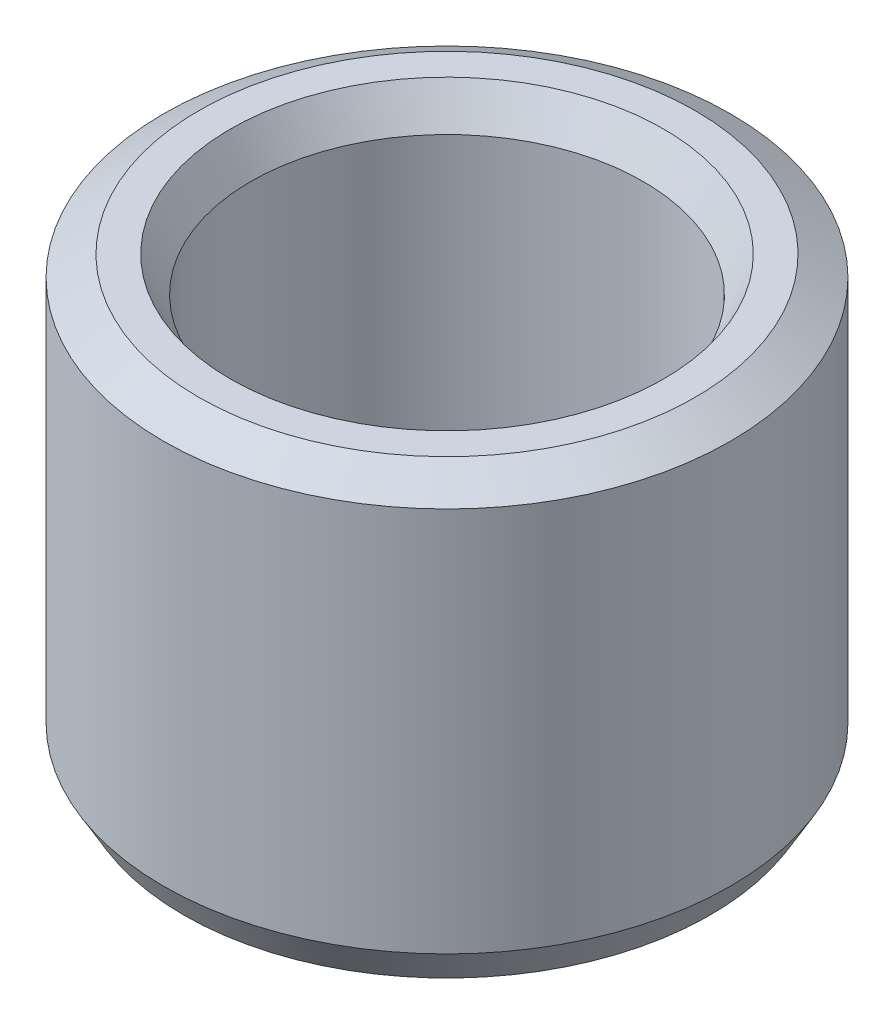
ISO-10303-21;
HEADER;
FILE_DESCRIPTION(('STEP AP214'),'2;1');
FILE_NAME('part.step','',(''),(''),'','','');
FILE_SCHEMA(('AUTOMOTIVE_DESIGN { 1 0 10303 214 1 1 1 1 }'));
ENDSEC;
DATA;
#1=APPLICATION_CONTEXT('core data for automotive mechanical design processes');
#2=APPLICATION_PROTOCOL_DEFINITION('international standard','automotive_design',2000,#1);
#3=PRODUCT_CONTEXT('',#1,'mechanical');
#4=PRODUCT('Part','Part','',(#3));
#5=PRODUCT_RELATED_PRODUCT_CATEGORY('part','',(#4));
#6=PRODUCT_DEFINITION_FORMATION('','',#4);
#7=PRODUCT_DEFINITION_CONTEXT('part definition',#1,'design');
#8=PRODUCT_DEFINITION('design','',#6,#7);
#9=PRODUCT_DEFINITION_SHAPE('','',#8);
#10=(LENGTH_UNIT() NAMED_UNIT(*) SI_UNIT(.MILLI.,.METRE.));
#11=(NAMED_UNIT(*) PLANE_ANGLE_UNIT() SI_UNIT($,.RADIAN.));
#12=(NAMED_UNIT(*) SI_UNIT($,.STERADIAN.) SOLID_ANGLE_UNIT());
#13=UNCERTAINTY_MEASURE_WITH_UNIT(LENGTH_MEASURE(1.E-05),#10,'distance_accuracy_value','');
#14=(GEOMETRIC_REPRESENTATION_CONTEXT(3) GLOBAL_UNCERTAINTY_ASSIGNED_CONTEXT((#13)) GLOBAL_UNIT_ASSIGNED_CONTEXT((#10,
#11,#12)) REPRESENTATION_CONTEXT('',''));
#15=CARTESIAN_POINT('',(0.,0.,0.));
#16=DIRECTION('',(0.,0.,1.));
#17=DIRECTION('',(1.,0.,0.));
#18=AXIS2_PLACEMENT_3D('',#15,#16,#17);
#19=CARTESIAN_POINT('',(0.,77.7685926189186,0.));
#20=DIRECTION('',(0.,-1.,0.));
#21=DIRECTION('',(0.,0.,-1.));
#22=AXIS2_PLACEMENT_3D('',#19,#20,#21);
#23=CYLINDRICAL_SURFACE('',#22,50.);
#24=CARTESIAN_POINT('',(0.,6.22092587514916,0.));
#25=DIRECTION('',(0.,1.,0.));
#26=DIRECTION('',(0.,0.,1.));
#27=AXIS2_PLACEMENT_3D('',#24,#25,#26);
#28=CIRCLE('',#27,50.);
#29=CARTESIAN_POINT('',(0.,6.22092587514916,50.));
#30=VERTEX_POINT('',#29);
#31=EDGE_CURVE('E10',#30,#30,#28,.T.);
#32=ORIENTED_EDGE('',*,*,#31,.T.);
#33=EDGE_LOOP('',(#32));
#34=FACE_BOUND('',#33,.T.);
#35=CARTESIAN_POINT('',(0.,74.1769393902925,0.));
#36=DIRECTION('',(0.,1.,0.));
#37=DIRECTION('',(0.,0.,1.));
#38=AXIS2_PLACEMENT_3D('',#35,#36,#37);
#39=CIRCLE('',#38,50.);
#40=CARTESIAN_POINT('',(0.,74.1769393902925,50.));
#41=VERTEX_POINT('',#40);
#42=EDGE_CURVE('E50',#41,#41,#39,.F.);
#43=ORIENTED_EDGE('',*,*,#42,.T.);
#44=EDGE_LOOP('',(#43));
#45=FACE_BOUND('',#44,.T.);
#46=ADVANCED_FACE('F39',(#34,#45),#23,.T.);
#47=CARTESIAN_POINT('',(0.,77.7685926189186,0.));
#48=DIRECTION('',(0.,1.,0.));
#49=DIRECTION('',(0.,0.,1.));
#50=AXIS2_PLACEMENT_3D('',#47,#48,#49);
#51=PLANE('',#50);
#52=CARTESIAN_POINT('',(0.,77.7685926189186,0.));
#53=DIRECTION('',(0.,1.,0.));
#54=DIRECTION('',(0.,0.,1.));
#55=AXIS2_PLACEMENT_3D('',#52,#53,#54);
#56=CIRCLE('',#55,38.1935949540589);
#57=CARTESIAN_POINT('',(0.,77.7685926189186,38.1935949540589));
#58=VERTEX_POINT('',#57);
#59=EDGE_CURVE('E58',#58,#58,#56,.F.);
#60=ORIENTED_EDGE('',*,*,#59,.T.);
#61=EDGE_LOOP('',(#60));
#62=FACE_BOUND('',#61,.T.);
#63=CARTESIAN_POINT('',(0.,77.7685926189186,0.));
#64=DIRECTION('',(0.,1.,0.));
#65=DIRECTION('',(0.,0.,1.));
#66=AXIS2_PLACEMENT_3D('',#63,#64,#65);
#67=CIRCLE('',#66,43.7790741248508);
#68=CARTESIAN_POINT('',(0.,77.7685926189186,43.7790741248508));
#69=VERTEX_POINT('',#68);
#70=EDGE_CURVE('E61',#69,#69,#67,.T.);
#71=ORIENTED_EDGE('',*,*,#70,.T.);
#72=EDGE_LOOP('',(#71));
#73=FACE_BOUND('',#72,.T.);
#74=ADVANCED_FACE('F88',(#62,#73),#51,.T.);
#75=CARTESIAN_POINT('',(0.,0.,0.));
#76=DIRECTION('',(0.,1.,0.));
#77=DIRECTION('',(0.,0.,1.));
#78=AXIS2_PLACEMENT_3D('',#75,#76,#77);
#79=PLANE('',#78);
#80=CARTESIAN_POINT('',(0.,0.,0.));
#81=DIRECTION('',(0.,1.,0.));
#82=DIRECTION('',(0.,0.,1.));
#83=AXIS2_PLACEMENT_3D('',#80,#81,#82);
#84=CIRCLE('',#83,40.8228676005819);
#85=CARTESIAN_POINT('',(0.,0.,40.8228676005819));
#86=VERTEX_POINT('',#85);
#87=EDGE_CURVE('E51',#86,#86,#84,.T.);
#88=ORIENTED_EDGE('',*,*,#87,.T.);
#89=EDGE_LOOP('',(#88));
#90=FACE_BOUND('',#89,.T.);
#91=CARTESIAN_POINT('',(0.,0.,0.));
#92=DIRECTION('',(0.,1.,0.));
#93=DIRECTION('',(0.,0.,1.));
#94=AXIS2_PLACEMENT_3D('',#91,#92,#93);
#95=CIRCLE('',#94,46.4083467713739);
#96=CARTESIAN_POINT('',(0.,0.,46.4083467713739));
#97=VERTEX_POINT('',#96);
#98=EDGE_CURVE('E54',#97,#97,#95,.F.);
#99=ORIENTED_EDGE('',*,*,#98,.T.);
#100=EDGE_LOOP('',(#99));
#101=FACE_BOUND('',#100,.T.);
#102=ADVANCED_FACE('F83',(#90,#101),#79,.F.);
#103=CARTESIAN_POINT('',(0.,77.7685926189186,0.));
#104=DIRECTION('',(0.,-1.,0.));
#105=DIRECTION('',(0.,0.,-1.));
#106=AXIS2_PLACEMENT_3D('',#103,#104,#105);
#107=CYLINDRICAL_SURFACE('',#106,34.6019417254328);
#108=CARTESIAN_POINT('',(0.,71.5476667437694,0.));
#109=DIRECTION('',(0.,1.,0.));
#110=DIRECTION('',(0.,0.,1.));
#111=AXIS2_PLACEMENT_3D('',#108,#109,#110);
#112=CIRCLE('',#111,34.6019417254328);
#113=CARTESIAN_POINT('',(0.,71.5476667437694,34.6019417254328));
#114=VERTEX_POINT('',#113);
#115=EDGE_CURVE('E67',#114,#114,#112,.T.);
#116=ORIENTED_EDGE('',*,*,#115,.T.);
#117=EDGE_LOOP('',(#116));
#118=FACE_BOUND('',#117,.T.);
#119=CARTESIAN_POINT('',(0.,3.59165322862612,0.));
#120=DIRECTION('',(0.,1.,0.));
#121=DIRECTION('',(0.,0.,1.));
#122=AXIS2_PLACEMENT_3D('',#119,#120,#121);
#123=CIRCLE('',#122,34.6019417254328);
#124=CARTESIAN_POINT('',(0.,3.59165322862612,34.6019417254328));
#125=VERTEX_POINT('',#124);
#126=EDGE_CURVE('E69',#125,#125,#123,.F.);
#127=ORIENTED_EDGE('',*,*,#126,.T.);
#128=EDGE_LOOP('',(#127));
#129=FACE_BOUND('',#128,.T.);
#130=ADVANCED_FACE('F71',(#118,#129),#107,.F.);
#131=CARTESIAN_POINT('',(0.,71.5476667437694,0.));
#132=DIRECTION('',(0.,1.,0.));
#133=DIRECTION('',(0.,0.,1.));
#134=AXIS2_PLACEMENT_3D('',#131,#132,#133);
#135=CONICAL_SURFACE('',#134,34.6019417254328,0.523598775598304);
#136=ORIENTED_EDGE('',*,*,#59,.F.);
#137=EDGE_LOOP('',(#136));
#138=FACE_BOUND('',#137,.T.);
#139=ORIENTED_EDGE('',*,*,#115,.F.);
#140=EDGE_LOOP('',(#139));
#141=FACE_BOUND('',#140,.T.);
#142=ADVANCED_FACE('F77',(#138,#141),#135,.F.);
#143=CARTESIAN_POINT('',(0.,0.,0.));
#144=DIRECTION('',(0.,-1.,0.));
#145=DIRECTION('',(0.,0.,-1.));
#146=AXIS2_PLACEMENT_3D('',#143,#144,#145);
#147=CONICAL_SURFACE('',#146,40.8228676005819,1.04719755119659);
#148=ORIENTED_EDGE('',*,*,#126,.F.);
#149=EDGE_LOOP('',(#148));
#150=FACE_BOUND('',#149,.T.);
#151=ORIENTED_EDGE('',*,*,#87,.F.);
#152=EDGE_LOOP('',(#151));
#153=FACE_BOUND('',#152,.T.);
#154=ADVANCED_FACE('F73',(#150,#153),#147,.F.);
#155=CARTESIAN_POINT('',(0.,6.22092587514916,0.));
#156=DIRECTION('',(0.,1.,0.));
#157=DIRECTION('',(0.,0.,1.));
#158=AXIS2_PLACEMENT_3D('',#155,#156,#157);
#159=CONICAL_SURFACE('',#158,50.,0.523598775598302);
#160=ORIENTED_EDGE('',*,*,#98,.F.);
#161=EDGE_LOOP('',(#160));
#162=FACE_BOUND('',#161,.T.);
#163=ORIENTED_EDGE('',*,*,#31,.F.);
#164=EDGE_LOOP('',(#163));
#165=FACE_BOUND('',#164,.T.);
#166=ADVANCED_FACE('F76',(#162,#165),#159,.T.);
#167=CARTESIAN_POINT('',(0.,77.7685926189186,0.));
#168=DIRECTION('',(0.,-1.,0.));
#169=DIRECTION('',(0.,0.,-1.));
#170=AXIS2_PLACEMENT_3D('',#167,#168,#169);
#171=CONICAL_SURFACE('',#170,43.7790741248508,1.04719755119659);
#172=ORIENTED_EDGE('',*,*,#42,.F.);
#173=EDGE_LOOP('',(#172));
#174=FACE_BOUND('',#173,.T.);
#175=ORIENTED_EDGE('',*,*,#70,.F.);
#176=EDGE_LOOP('',(#175));
#177=FACE_BOUND('',#176,.T.);
#178=ADVANCED_FACE('F45',(#174,#177),#171,.T.);
#179=CLOSED_SHELL('',(#46,#74,#102,#130,#142,#154,#166,#178));
#180=MANIFOLD_SOLID_BREP('B2',#179);
#181=ADVANCED_BREP_SHAPE_REPRESENTATION('',(#18,#180),#14);
#182=SHAPE_DEFINITION_REPRESENTATION(#9,#181);
ENDSEC;
END-ISO-10303-21;
